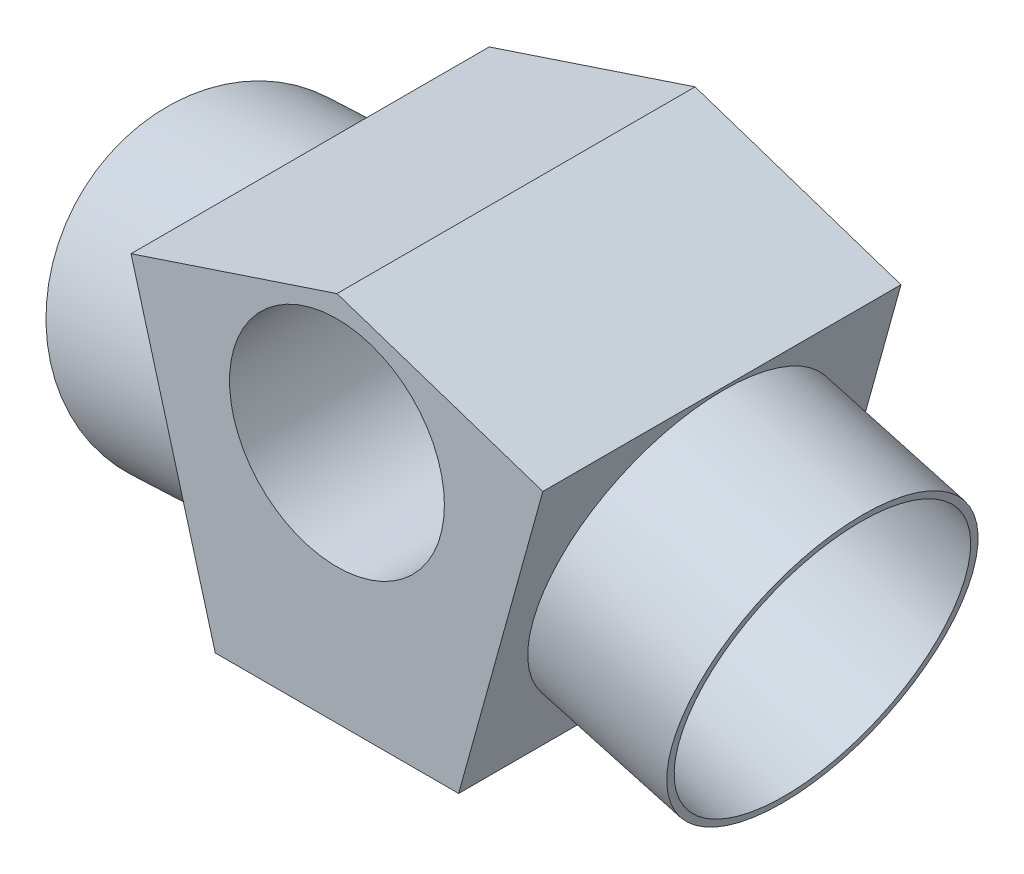
ISO-10303-21;
HEADER;
FILE_DESCRIPTION(('STEP AP214'),'2;1');
FILE_NAME('part.step','',(''),(''),'','','');
FILE_SCHEMA(('AUTOMOTIVE_DESIGN { 1 0 10303 214 1 1 1 1 }'));
ENDSEC;
DATA;
#1=APPLICATION_CONTEXT('core data for automotive mechanical design processes');
#2=APPLICATION_PROTOCOL_DEFINITION('international standard','automotive_design',2000,#1);
#3=PRODUCT_CONTEXT('',#1,'mechanical');
#4=PRODUCT('Part','Part','',(#3));
#5=PRODUCT_RELATED_PRODUCT_CATEGORY('part','',(#4));
#6=PRODUCT_DEFINITION_FORMATION('','',#4);
#7=PRODUCT_DEFINITION_CONTEXT('part definition',#1,'design');
#8=PRODUCT_DEFINITION('design','',#6,#7);
#9=PRODUCT_DEFINITION_SHAPE('','',#8);
#10=(LENGTH_UNIT() NAMED_UNIT(*) SI_UNIT(.MILLI.,.METRE.));
#11=(NAMED_UNIT(*) PLANE_ANGLE_UNIT() SI_UNIT($,.RADIAN.));
#12=(NAMED_UNIT(*) SI_UNIT($,.STERADIAN.) SOLID_ANGLE_UNIT());
#13=UNCERTAINTY_MEASURE_WITH_UNIT(LENGTH_MEASURE(1.E-05),#10,'distance_accuracy_value','');
#14=(GEOMETRIC_REPRESENTATION_CONTEXT(3) GLOBAL_UNCERTAINTY_ASSIGNED_CONTEXT((#13)) GLOBAL_UNIT_ASSIGNED_CONTEXT((#10,
#11,#12)) REPRESENTATION_CONTEXT('',''));
#15=CARTESIAN_POINT('',(0.,0.,0.));
#16=DIRECTION('',(0.,0.,1.));
#17=DIRECTION('',(1.,0.,0.));
#18=AXIS2_PLACEMENT_3D('',#15,#16,#17);
#19=CARTESIAN_POINT('',(0.,9.02241335596712,-25.));
#20=DIRECTION('',(0.315177046038834,0.949032891764155,0.));
#21=DIRECTION('',(-0.949032891764155,0.315177046038834,0.));
#22=AXIS2_PLACEMENT_3D('',#19,#20,#21);
#23=PLANE('',#22);
#24=DIRECTION('',(-0.949032891764155,0.315177046038834,0.));
#25=VECTOR('',#24,1.);
#26=CARTESIAN_POINT('',(0.,9.02241335596712,-50.));
#27=LINE('',#26,#25);
#28=CARTESIAN_POINT('',(14.3742711389531,4.24866909920602,-50.));
#29=VERTEX_POINT('',#28);
#30=CARTESIAN_POINT('',(0.,9.02241335596712,-50.));
#31=VERTEX_POINT('',#30);
#32=EDGE_CURVE('E130',#29,#31,#27,.T.);
#33=ORIENTED_EDGE('',*,*,#32,.T.);
#34=DIRECTION('',(0.,0.,-1.));
#35=VECTOR('',#34,1.);
#36=CARTESIAN_POINT('',(0.,9.02241335596712,-25.));
#37=LINE('',#36,#35);
#38=CARTESIAN_POINT('',(0.,9.02241335596712,-25.));
#39=VERTEX_POINT('',#38);
#40=EDGE_CURVE('E126',#39,#31,#37,.T.);
#41=ORIENTED_EDGE('',*,*,#40,.F.);
#42=DIRECTION('',(-0.949032891764155,0.315177046038834,0.));
#43=VECTOR('',#42,1.);
#44=CARTESIAN_POINT('',(0.,9.02241335596712,-25.));
#45=LINE('',#44,#43);
#46=CARTESIAN_POINT('',(14.3742711389531,4.24866909920602,-25.));
#47=VERTEX_POINT('',#46);
#48=EDGE_CURVE('E139',#47,#39,#45,.T.);
#49=ORIENTED_EDGE('',*,*,#48,.F.);
#50=DIRECTION('',(0.,0.,-1.));
#51=VECTOR('',#50,1.);
#52=CARTESIAN_POINT('',(14.3742711389531,4.24866909920602,-25.));
#53=LINE('',#52,#51);
#54=EDGE_CURVE('E140',#47,#29,#53,.T.);
#55=ORIENTED_EDGE('',*,*,#54,.T.);
#56=EDGE_LOOP('',(#33,#41,#49,#55));
#57=FACE_BOUND('',#56,.T.);
#58=ADVANCED_FACE('F54',(#57),#23,.T.);
#59=CARTESIAN_POINT('',(14.3742711389531,4.24866909920602,-25.));
#60=DIRECTION('',(0.963630453208622,-0.267238376078261,0.));
#61=DIRECTION('',(0.267238376078261,0.963630453208622,0.));
#62=AXIS2_PLACEMENT_3D('',#59,#60,#61);
#63=PLANE('',#62);
#64=CARTESIAN_POINT('',(11.5001030027421,-6.11524638456314,-37.6841917500769));
#65=DIRECTION('',(-0.963630453208622,0.267238376078261,0.));
#66=DIRECTION('',(0.267238376078261,0.963630453208622,0.));
#67=AXIS2_PLACEMENT_3D('',#64,#65,#66);
#68=CIRCLE('',#67,10.5);
#69=CARTESIAN_POINT('',(14.3061059515638,4.00287337412739,-37.6841917500769));
#70=VERTEX_POINT('',#69);
#71=EDGE_CURVE('E12',#70,#70,#68,.T.);
#72=ORIENTED_EDGE('',*,*,#71,.T.);
#73=EDGE_LOOP('',(#72));
#74=FACE_BOUND('',#73,.T.);
#75=DIRECTION('',(0.267238376078261,0.963630453208622,0.));
#76=VECTOR('',#75,1.);
#77=CARTESIAN_POINT('',(14.3742711389531,4.24866909920602,-50.));
#78=LINE('',#77,#76);
#79=CARTESIAN_POINT('',(8.4950268652314,-16.9512008713837,-50.));
#80=VERTEX_POINT('',#79);
#81=EDGE_CURVE('E96',#80,#29,#78,.T.);
#82=ORIENTED_EDGE('',*,*,#81,.T.);
#83=ORIENTED_EDGE('',*,*,#54,.F.);
#84=DIRECTION('',(0.267238376078261,0.963630453208622,0.));
#85=VECTOR('',#84,1.);
#86=CARTESIAN_POINT('',(14.3742711389531,4.24866909920602,-25.));
#87=LINE('',#86,#85);
#88=CARTESIAN_POINT('',(8.4950268652314,-16.9512008713837,-25.));
#89=VERTEX_POINT('',#88);
#90=EDGE_CURVE('E70',#89,#47,#87,.T.);
#91=ORIENTED_EDGE('',*,*,#90,.F.);
#92=DIRECTION('',(0.,0.,-1.));
#93=VECTOR('',#92,1.);
#94=CARTESIAN_POINT('',(8.4950268652314,-16.9512008713837,-25.));
#95=LINE('',#94,#93);
#96=EDGE_CURVE('E121',#89,#80,#95,.T.);
#97=ORIENTED_EDGE('',*,*,#96,.T.);
#98=EDGE_LOOP('',(#82,#83,#91,#97));
#99=FACE_BOUND('',#98,.T.);
#100=ADVANCED_FACE('F188',(#74,#99),#63,.T.);
#101=CARTESIAN_POINT('',(-8.4950268652314,-16.9512008713837,-25.));
#102=DIRECTION('',(0.,-1.,0.));
#103=DIRECTION('',(0.,0.,1.));
#104=AXIS2_PLACEMENT_3D('',#101,#102,#103);
#105=PLANE('',#104);
#106=DIRECTION('',(1.,0.,0.));
#107=VECTOR('',#106,1.);
#108=CARTESIAN_POINT('',(-8.4950268652314,-16.9512008713837,-50.));
#109=LINE('',#108,#107);
#110=CARTESIAN_POINT('',(-8.4950268652314,-16.9512008713837,-50.));
#111=VERTEX_POINT('',#110);
#112=EDGE_CURVE('E90',#111,#80,#109,.T.);
#113=ORIENTED_EDGE('',*,*,#112,.T.);
#114=ORIENTED_EDGE('',*,*,#96,.F.);
#115=DIRECTION('',(1.,0.,0.));
#116=VECTOR('',#115,1.);
#117=CARTESIAN_POINT('',(-8.4950268652314,-16.9512008713837,-25.));
#118=LINE('',#117,#116);
#119=CARTESIAN_POINT('',(-8.4950268652314,-16.9512008713837,-25.));
#120=VERTEX_POINT('',#119);
#121=EDGE_CURVE('E113',#120,#89,#118,.T.);
#122=ORIENTED_EDGE('',*,*,#121,.F.);
#123=DIRECTION('',(0.,0.,-1.));
#124=VECTOR('',#123,1.);
#125=CARTESIAN_POINT('',(-8.4950268652314,-16.9512008713837,-25.));
#126=LINE('',#125,#124);
#127=EDGE_CURVE('E117',#120,#111,#126,.T.);
#128=ORIENTED_EDGE('',*,*,#127,.T.);
#129=EDGE_LOOP('',(#113,#114,#122,#128));
#130=FACE_BOUND('',#129,.T.);
#131=ADVANCED_FACE('F124',(#130),#105,.T.);
#132=CARTESIAN_POINT('',(-14.3742711389531,4.24866909920602,-25.));
#133=DIRECTION('',(-0.963630453208622,-0.267238376078261,0.));
#134=DIRECTION('',(0.267238376078261,-0.963630453208622,0.));
#135=AXIS2_PLACEMENT_3D('',#132,#133,#134);
#136=PLANE('',#135);
#137=CARTESIAN_POINT('',(-11.4346490020923,-6.35126588608882,-37.5));
#138=DIRECTION('',(0.963630453208622,0.267238376078261,0.));
#139=DIRECTION('',(0.,0.,-1.));
#140=AXIS2_PLACEMENT_3D('',#137,#138,#139);
#141=ELLIPSE('',#140,10.7779978073166,10.5);
#142=CARTESIAN_POINT('',(-11.4346490020923,-6.35126588608882,-48.2779978073166));
#143=VERTEX_POINT('',#142);
#144=EDGE_CURVE('E146',#143,#143,#141,.F.);
#145=ORIENTED_EDGE('',*,*,#144,.F.);
#146=EDGE_LOOP('',(#145));
#147=FACE_BOUND('',#146,.T.);
#148=DIRECTION('',(0.267238376078261,-0.963630453208622,0.));
#149=VECTOR('',#148,1.);
#150=CARTESIAN_POINT('',(-14.3742711389531,4.24866909920602,-50.));
#151=LINE('',#150,#149);
#152=CARTESIAN_POINT('',(-14.3742711389531,4.24866909920602,-50.));
#153=VERTEX_POINT('',#152);
#154=EDGE_CURVE('E120',#153,#111,#151,.T.);
#155=ORIENTED_EDGE('',*,*,#154,.T.);
#156=ORIENTED_EDGE('',*,*,#127,.F.);
#157=DIRECTION('',(0.267238376078261,-0.963630453208622,0.));
#158=VECTOR('',#157,1.);
#159=CARTESIAN_POINT('',(-14.3742711389531,4.24866909920602,-25.));
#160=LINE('',#159,#158);
#161=CARTESIAN_POINT('',(-14.3742711389531,4.24866909920602,-25.));
#162=VERTEX_POINT('',#161);
#163=EDGE_CURVE('E109',#162,#120,#160,.T.);
#164=ORIENTED_EDGE('',*,*,#163,.F.);
#165=DIRECTION('',(0.,0.,-1.));
#166=VECTOR('',#165,1.);
#167=CARTESIAN_POINT('',(-14.3742711389531,4.24866909920602,-25.));
#168=LINE('',#167,#166);
#169=EDGE_CURVE('E122',#162,#153,#168,.T.);
#170=ORIENTED_EDGE('',*,*,#169,.T.);
#171=EDGE_LOOP('',(#155,#156,#164,#170));
#172=FACE_BOUND('',#171,.T.);
#173=ADVANCED_FACE('F118',(#147,#172),#136,.T.);
#174=CARTESIAN_POINT('',(0.,9.02241335596712,-25.));
#175=DIRECTION('',(-0.315177046038834,0.949032891764155,0.));
#176=DIRECTION('',(-0.949032891764155,-0.315177046038834,0.));
#177=AXIS2_PLACEMENT_3D('',#174,#175,#176);
#178=PLANE('',#177);
#179=DIRECTION('',(-0.949032891764155,-0.315177046038834,0.));
#180=VECTOR('',#179,1.);
#181=CARTESIAN_POINT('',(0.,9.02241335596712,-50.));
#182=LINE('',#181,#180);
#183=EDGE_CURVE('E133',#31,#153,#182,.T.);
#184=ORIENTED_EDGE('',*,*,#183,.T.);
#185=ORIENTED_EDGE('',*,*,#169,.F.);
#186=DIRECTION('',(-0.949032891764155,-0.315177046038834,0.));
#187=VECTOR('',#186,1.);
#188=CARTESIAN_POINT('',(0.,9.02241335596712,-25.));
#189=LINE('',#188,#187);
#190=EDGE_CURVE('E105',#39,#162,#189,.T.);
#191=ORIENTED_EDGE('',*,*,#190,.F.);
#192=ORIENTED_EDGE('',*,*,#40,.T.);
#193=EDGE_LOOP('',(#184,#185,#191,#192));
#194=FACE_BOUND('',#193,.T.);
#195=ADVANCED_FACE('F170',(#194),#178,.T.);
#196=CARTESIAN_POINT('',(0.,0.,-25.));
#197=DIRECTION('',(0.,0.,1.));
#198=DIRECTION('',(-1.,0.,0.));
#199=AXIS2_PLACEMENT_3D('',#196,#197,#198);
#200=PLANE('',#199);
#201=CARTESIAN_POINT('',(0.,0.,-25.));
#202=DIRECTION('',(0.,0.,1.));
#203=DIRECTION('',(1.,0.,0.));
#204=AXIS2_PLACEMENT_3D('',#201,#202,#203);
#205=CIRCLE('',#204,7.5);
#206=CARTESIAN_POINT('',(7.5,0.,-25.));
#207=VERTEX_POINT('',#206);
#208=EDGE_CURVE('E134',#207,#207,#205,.T.);
#209=ORIENTED_EDGE('',*,*,#208,.F.);
#210=EDGE_LOOP('',(#209));
#211=FACE_BOUND('',#210,.T.);
#212=ORIENTED_EDGE('',*,*,#48,.T.);
#213=ORIENTED_EDGE('',*,*,#190,.T.);
#214=ORIENTED_EDGE('',*,*,#163,.T.);
#215=ORIENTED_EDGE('',*,*,#121,.T.);
#216=ORIENTED_EDGE('',*,*,#90,.T.);
#217=EDGE_LOOP('',(#212,#213,#214,#215,#216));
#218=FACE_BOUND('',#217,.T.);
#219=ADVANCED_FACE('F111',(#211,#218),#200,.T.);
#220=CARTESIAN_POINT('',(0.,0.,-50.));
#221=DIRECTION('',(0.,0.,1.));
#222=DIRECTION('',(-1.,0.,0.));
#223=AXIS2_PLACEMENT_3D('',#220,#221,#222);
#224=PLANE('',#223);
#225=CARTESIAN_POINT('',(0.,0.,-50.));
#226=DIRECTION('',(0.,0.,1.));
#227=DIRECTION('',(1.,0.,0.));
#228=AXIS2_PLACEMENT_3D('',#225,#226,#227);
#229=CIRCLE('',#228,7.5);
#230=CARTESIAN_POINT('',(7.5,0.,-50.));
#231=VERTEX_POINT('',#230);
#232=EDGE_CURVE('E148',#231,#231,#229,.T.);
#233=ORIENTED_EDGE('',*,*,#232,.T.);
#234=EDGE_LOOP('',(#233));
#235=FACE_BOUND('',#234,.T.);
#236=ORIENTED_EDGE('',*,*,#32,.F.);
#237=ORIENTED_EDGE('',*,*,#81,.F.);
#238=ORIENTED_EDGE('',*,*,#112,.F.);
#239=ORIENTED_EDGE('',*,*,#154,.F.);
#240=ORIENTED_EDGE('',*,*,#183,.F.);
#241=EDGE_LOOP('',(#236,#237,#238,#239,#240));
#242=FACE_BOUND('',#241,.T.);
#243=ADVANCED_FACE('F172',(#235,#242),#224,.F.);
#244=CARTESIAN_POINT('',(0.,0.,-25.));
#245=DIRECTION('',(0.,0.,-1.));
#246=DIRECTION('',(1.,0.,0.));
#247=AXIS2_PLACEMENT_3D('',#244,#245,#246);
#248=CYLINDRICAL_SURFACE('',#247,7.5);
#249=ORIENTED_EDGE('',*,*,#208,.T.);
#250=EDGE_LOOP('',(#249));
#251=FACE_BOUND('',#250,.T.);
#252=ORIENTED_EDGE('',*,*,#232,.F.);
#253=EDGE_LOOP('',(#252));
#254=FACE_BOUND('',#253,.T.);
#255=ADVANCED_FACE('F174',(#251,#254),#248,.F.);
#256=CARTESIAN_POINT('',(-8.61832264735264,-5.57022946383693,-36.8230303029567));
#257=DIRECTION('',(-0.938775451579877,-0.260345474083962,-0.225656565681116));
#258=DIRECTION('',(0.267238376078261,-0.963630453208622,0.));
#259=AXIS2_PLACEMENT_3D('',#256,#257,#258);
#260=CYLINDRICAL_SURFACE('',#259,10.5);
#261=ORIENTED_EDGE('',*,*,#144,.T.);
#262=EDGE_LOOP('',(#261));
#263=FACE_BOUND('',#262,.T.);
#264=CARTESIAN_POINT('',(-22.6999544210508,-9.47541157509637,-40.2078787881734));
#265=DIRECTION('',(-0.938775451579877,-0.260345474083962,-0.225656565681116));
#266=DIRECTION('',(0.267238376078261,-0.963630453208622,0.));
#267=AXIS2_PLACEMENT_3D('',#264,#265,#266);
#268=CIRCLE('',#267,10.5);
#269=CARTESIAN_POINT('',(-19.8939514722291,-19.5935313337869,-40.2078787881734));
#270=VERTEX_POINT('',#269);
#271=EDGE_CURVE('E149',#270,#270,#268,.T.);
#272=ORIENTED_EDGE('',*,*,#271,.F.);
#273=EDGE_LOOP('',(#272));
#274=FACE_BOUND('',#273,.T.);
#275=ADVANCED_FACE('F181',(#263,#274),#260,.T.);
#276=CARTESIAN_POINT('',(-8.61832264735264,-5.57022946383693,-36.8230303029567));
#277=DIRECTION('',(-0.938775451579877,-0.260345474083962,-0.225656565681116));
#278=DIRECTION('',(0.267238376078261,-0.963630453208622,0.));
#279=AXIS2_PLACEMENT_3D('',#276,#277,#278);
#280=CYLINDRICAL_SURFACE('',#279,10.);
#281=CARTESIAN_POINT('',(-11.4346490020923,-6.35126588608882,-37.5));
#282=DIRECTION('',(0.963630453208622,0.267238376078261,0.));
#283=DIRECTION('',(0.,0.,-1.));
#284=AXIS2_PLACEMENT_3D('',#281,#282,#283);
#285=ELLIPSE('',#284,10.264759816492,10.);
#286=CARTESIAN_POINT('',(-11.4346490020923,-6.35126588608882,-47.764759816492));
#287=VERTEX_POINT('',#286);
#288=EDGE_CURVE('E62',#287,#287,#285,.F.);
#289=ORIENTED_EDGE('',*,*,#288,.F.);
#290=EDGE_LOOP('',(#289));
#291=FACE_BOUND('',#290,.T.);
#292=CARTESIAN_POINT('',(-22.6999544210508,-9.47541157509637,-40.2078787881734));
#293=DIRECTION('',(-0.938775451579877,-0.260345474083962,-0.225656565681116));
#294=DIRECTION('',(-0.267238376078261,0.963630453208622,0.));
#295=AXIS2_PLACEMENT_3D('',#292,#293,#294);
#296=CIRCLE('',#295,10.);
#297=CARTESIAN_POINT('',(-25.3723381818334,0.160892956989858,-40.2078787881734));
#298=VERTEX_POINT('',#297);
#299=EDGE_CURVE('E155',#298,#298,#296,.T.);
#300=ORIENTED_EDGE('',*,*,#299,.T.);
#301=EDGE_LOOP('',(#300));
#302=FACE_BOUND('',#301,.T.);
#303=ADVANCED_FACE('F229',(#291,#302),#280,.F.);
#304=CARTESIAN_POINT('',(-22.6999544210508,-9.47541157509637,-40.2078787881734));
#305=DIRECTION('',(0.938775451579877,0.260345474083962,0.225656565681116));
#306=DIRECTION('',(-0.267238376078261,0.963630453208622,0.));
#307=AXIS2_PLACEMENT_3D('',#304,#305,#306);
#308=PLANE('',#307);
#309=ORIENTED_EDGE('',*,*,#299,.F.);
#310=EDGE_LOOP('',(#309));
#311=FACE_BOUND('',#310,.T.);
#312=ORIENTED_EDGE('',*,*,#271,.T.);
#313=EDGE_LOOP('',(#312));
#314=FACE_BOUND('',#313,.T.);
#315=ADVANCED_FACE('F238',(#311,#314),#308,.F.);
#316=ORIENTED_EDGE('',*,*,#288,.T.);
#317=EDGE_LOOP('',(#316));
#318=FACE_BOUND('',#317,.T.);
#319=ADVANCED_FACE('F200',(#318),#136,.T.);
#320=CARTESIAN_POINT('',(9.64008677654258,-5.59941823268846,-37.6841917500769));
#321=DIRECTION('',(0.963630453208623,-0.267238376078257,0.));
#322=DIRECTION('',(0.267238376078258,0.963630453208623,0.));
#323=AXIS2_PLACEMENT_3D('',#320,#321,#322);
#324=CYLINDRICAL_SURFACE('',#323,10.5);
#325=ORIENTED_EDGE('',*,*,#71,.F.);
#326=EDGE_LOOP('',(#325));
#327=FACE_BOUND('',#326,.T.);
#328=CARTESIAN_POINT('',(21.2036522150461,-8.80627874562755,-37.6841917500769));
#329=DIRECTION('',(-0.963630453208623,0.267238376078257,0.));
#330=DIRECTION('',(0.,0.,1.));
#331=AXIS2_PLACEMENT_3D('',#328,#329,#330);
#332=CIRCLE('',#331,10.5);
#333=CARTESIAN_POINT('',(21.2036522150461,-8.80627874562755,-27.1841917500769));
#334=VERTEX_POINT('',#333);
#335=EDGE_CURVE('E309',#334,#334,#332,.T.);
#336=ORIENTED_EDGE('',*,*,#335,.T.);
#337=EDGE_LOOP('',(#336));
#338=FACE_BOUND('',#337,.T.);
#339=ADVANCED_FACE('F257',(#327,#338),#324,.T.);
#340=CARTESIAN_POINT('',(21.2036522150461,-8.80627874562755,-37.6841917500769));
#341=DIRECTION('',(0.963630453208623,-0.267238376078257,0.));
#342=DIRECTION('',(0.267238376078257,0.963630453208623,0.));
#343=AXIS2_PLACEMENT_3D('',#340,#341,#342);
#344=PLANE('',#343);
#345=CARTESIAN_POINT('',(21.2036522150461,-8.80627874562755,-37.6841917500769));
#346=DIRECTION('',(-0.963630453208623,0.267238376078257,0.));
#347=DIRECTION('',(0.267238376078257,0.963630453208623,0.));
#348=AXIS2_PLACEMENT_3D('',#345,#346,#347);
#349=CIRCLE('',#348,10.);
#350=CARTESIAN_POINT('',(23.8760359758286,0.830025786458686,-37.6841917500769));
#351=VERTEX_POINT('',#350);
#352=EDGE_CURVE('E308',#351,#351,#349,.T.);
#353=ORIENTED_EDGE('',*,*,#352,.T.);
#354=EDGE_LOOP('',(#353));
#355=FACE_BOUND('',#354,.T.);
#356=ORIENTED_EDGE('',*,*,#335,.F.);
#357=EDGE_LOOP('',(#356));
#358=FACE_BOUND('',#357,.T.);
#359=ADVANCED_FACE('F266',(#355,#358),#344,.T.);
#360=CARTESIAN_POINT('',(8.67645632333397,-5.3321798566102,-37.6841917500769));
#361=DIRECTION('',(0.963630453208623,-0.267238376078257,0.));
#362=DIRECTION('',(0.267238376078257,0.963630453208623,0.));
#363=AXIS2_PLACEMENT_3D('',#360,#361,#362);
#364=PLANE('',#363);
#365=CARTESIAN_POINT('',(8.67645632333397,-5.3321798566102,-37.6841917500769));
#366=DIRECTION('',(-0.963630453208623,0.267238376078257,0.));
#367=DIRECTION('',(0.267238376078257,0.963630453208623,0.));
#368=AXIS2_PLACEMENT_3D('',#365,#366,#367);
#369=CIRCLE('',#368,10.);
#370=CARTESIAN_POINT('',(11.3488400841165,4.30412467547603,-37.6841917500769));
#371=VERTEX_POINT('',#370);
#372=EDGE_CURVE('E160',#371,#371,#369,.T.);
#373=ORIENTED_EDGE('',*,*,#372,.F.);
#374=EDGE_LOOP('',(#373));
#375=FACE_BOUND('',#374,.T.);
#376=ADVANCED_FACE('F276',(#375),#364,.T.);
#377=CARTESIAN_POINT('',(8.67645632333397,-5.3321798566102,-37.6841917500769));
#378=DIRECTION('',(0.963630453208623,-0.267238376078257,0.));
#379=DIRECTION('',(0.267238376078257,0.963630453208623,0.));
#380=AXIS2_PLACEMENT_3D('',#377,#378,#379);
#381=CYLINDRICAL_SURFACE('',#380,10.);
#382=ORIENTED_EDGE('',*,*,#372,.T.);
#383=EDGE_LOOP('',(#382));
#384=FACE_BOUND('',#383,.T.);
#385=ORIENTED_EDGE('',*,*,#352,.F.);
#386=EDGE_LOOP('',(#385));
#387=FACE_BOUND('',#386,.T.);
#388=ADVANCED_FACE('F286',(#384,#387),#381,.F.);
#389=CLOSED_SHELL('',(#58,#100,#131,#173,#195,#219,#243,#255,#275,#303,#315,#319,#339,#359,#376,#388));
#390=MANIFOLD_SOLID_BREP('B2',#389);
#391=ADVANCED_BREP_SHAPE_REPRESENTATION('',(#18,#390),#14);
#392=SHAPE_DEFINITION_REPRESENTATION(#9,#391);
ENDSEC;
END-ISO-10303-21;
